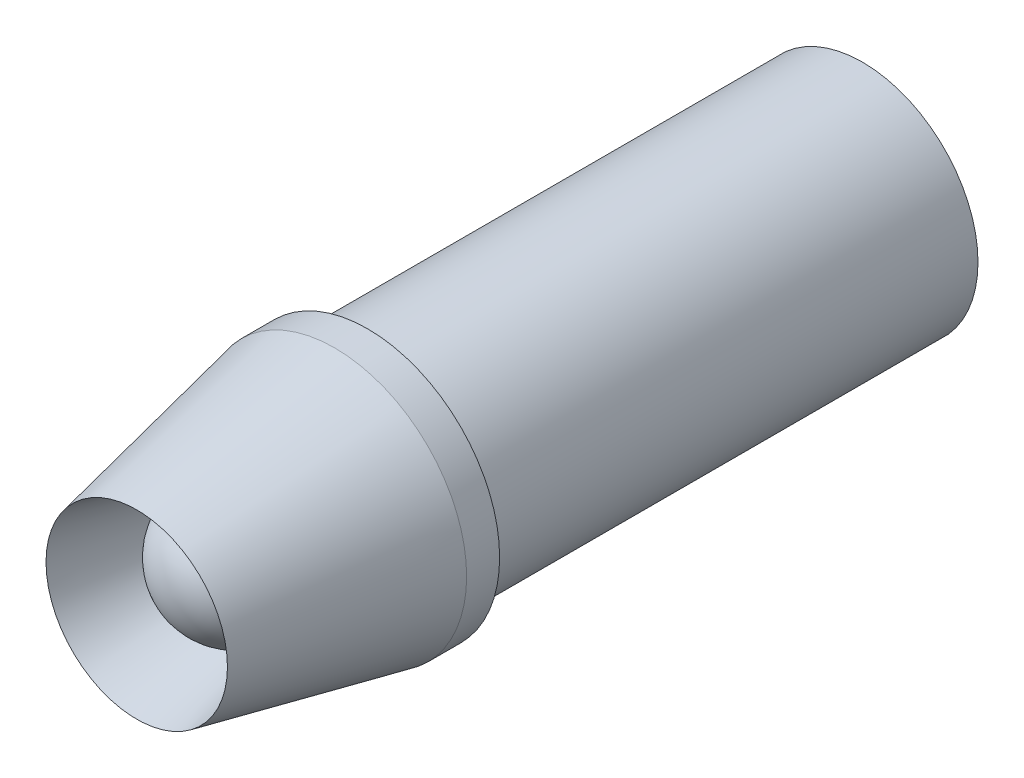
ISO-10303-21;
HEADER;
FILE_DESCRIPTION(('STEP AP214'),'2;1');
FILE_NAME('part.step','',(''),(''),'','','');
FILE_SCHEMA(('AUTOMOTIVE_DESIGN { 1 0 10303 214 1 1 1 1 }'));
ENDSEC;
DATA;
#1=APPLICATION_CONTEXT('core data for automotive mechanical design processes');
#2=APPLICATION_PROTOCOL_DEFINITION('international standard','automotive_design',2000,#1);
#3=PRODUCT_CONTEXT('',#1,'mechanical');
#4=PRODUCT('Part','Part','',(#3));
#5=PRODUCT_RELATED_PRODUCT_CATEGORY('part','',(#4));
#6=PRODUCT_DEFINITION_FORMATION('','',#4);
#7=PRODUCT_DEFINITION_CONTEXT('part definition',#1,'design');
#8=PRODUCT_DEFINITION('design','',#6,#7);
#9=PRODUCT_DEFINITION_SHAPE('','',#8);
#10=(LENGTH_UNIT() NAMED_UNIT(*) SI_UNIT(.MILLI.,.METRE.));
#11=(NAMED_UNIT(*) PLANE_ANGLE_UNIT() SI_UNIT($,.RADIAN.));
#12=(NAMED_UNIT(*) SI_UNIT($,.STERADIAN.) SOLID_ANGLE_UNIT());
#13=UNCERTAINTY_MEASURE_WITH_UNIT(LENGTH_MEASURE(1.E-05),#10,'distance_accuracy_value','');
#14=(GEOMETRIC_REPRESENTATION_CONTEXT(3) GLOBAL_UNCERTAINTY_ASSIGNED_CONTEXT((#13)) GLOBAL_UNIT_ASSIGNED_CONTEXT((#10,
#11,#12)) REPRESENTATION_CONTEXT('',''));
#15=CARTESIAN_POINT('',(0.,0.,0.));
#16=DIRECTION('',(0.,0.,1.));
#17=DIRECTION('',(1.,0.,0.));
#18=AXIS2_PLACEMENT_3D('',#15,#16,#17);
#19=CARTESIAN_POINT('',(0.,0.,3.99999999999997));
#20=DIRECTION('',(0.,0.,1.));
#21=DIRECTION('',(1.,0.,0.));
#22=AXIS2_PLACEMENT_3D('',#19,#20,#21);
#23=PLANE('',#22);
#24=CARTESIAN_POINT('',(0.,0.,3.99999999999997));
#25=DIRECTION('',(0.,0.,1.));
#26=DIRECTION('',(1.,0.,0.));
#27=AXIS2_PLACEMENT_3D('',#24,#25,#26);
#28=CIRCLE('',#27,2.);
#29=CARTESIAN_POINT('',(2.,0.,3.99999999999997));
#30=VERTEX_POINT('',#29);
#31=EDGE_CURVE('E11',#30,#30,#28,.T.);
#32=ORIENTED_EDGE('',*,*,#31,.F.);
#33=EDGE_LOOP('',(#32));
#34=FACE_BOUND('',#33,.T.);
#35=ADVANCED_FACE('F40',(#34),#23,.F.);
#36=CARTESIAN_POINT('',(0.,0.,3.99999999999997));
#37=DIRECTION('',(0.,0.,1.));
#38=DIRECTION('',(1.,0.,0.));
#39=AXIS2_PLACEMENT_3D('',#36,#37,#38);
#40=SPHERICAL_SURFACE('',#39,2.);
#41=ORIENTED_EDGE('',*,*,#31,.T.);
#42=EDGE_LOOP('',(#41));
#43=FACE_BOUND('',#42,.T.);
#44=ADVANCED_FACE('F42',(#43),#40,.T.);
#45=CLOSED_SHELL('',(#35,#44));
#46=MANIFOLD_SOLID_BREP('B2',#45);
#47=CARTESIAN_POINT('',(0.,0.,0.));
#48=DIRECTION('',(0.,0.,1.));
#49=DIRECTION('',(1.,0.,0.));
#50=AXIS2_PLACEMENT_3D('',#47,#48,#49);
#51=PLANE('',#50);
#52=CARTESIAN_POINT('',(0.,0.,0.));
#53=DIRECTION('',(0.,0.,1.));
#54=DIRECTION('',(1.,0.,0.));
#55=AXIS2_PLACEMENT_3D('',#52,#53,#54);
#56=CIRCLE('',#55,3.5);
#57=CARTESIAN_POINT('',(3.5,0.,0.));
#58=VERTEX_POINT('',#57);
#59=EDGE_CURVE('E39',#58,#58,#56,.F.);
#60=ORIENTED_EDGE('',*,*,#59,.F.);
#61=EDGE_LOOP('',(#60));
#62=FACE_BOUND('',#61,.T.);
#63=CARTESIAN_POINT('',(0.,0.,0.));
#64=DIRECTION('',(0.,0.,1.));
#65=DIRECTION('',(1.,0.,0.));
#66=AXIS2_PLACEMENT_3D('',#63,#64,#65);
#67=CIRCLE('',#66,4.);
#68=CARTESIAN_POINT('',(4.,0.,0.));
#69=VERTEX_POINT('',#68);
#70=EDGE_CURVE('E87',#69,#69,#67,.T.);
#71=ORIENTED_EDGE('',*,*,#70,.F.);
#72=EDGE_LOOP('',(#71));
#73=FACE_BOUND('',#72,.T.);
#74=ADVANCED_FACE('F67',(#62,#73),#51,.F.);
#75=CARTESIAN_POINT('',(0.,0.,7.));
#76=DIRECTION('',(0.,0.,-1.));
#77=DIRECTION('',(-1.,0.,0.));
#78=AXIS2_PLACEMENT_3D('',#75,#76,#77);
#79=CYLINDRICAL_SURFACE('',#78,4.);
#80=CARTESIAN_POINT('',(0.,0.,0.999999999999906));
#81=DIRECTION('',(0.,0.,1.));
#82=DIRECTION('',(1.,0.,0.));
#83=AXIS2_PLACEMENT_3D('',#80,#81,#82);
#84=CIRCLE('',#83,4.);
#85=CARTESIAN_POINT('',(-4.,0.,0.999999999999906));
#86=VERTEX_POINT('',#85);
#87=EDGE_CURVE('E78',#86,#86,#84,.F.);
#88=ORIENTED_EDGE('',*,*,#87,.T.);
#89=EDGE_LOOP('',(#88));
#90=FACE_BOUND('',#89,.T.);
#91=ORIENTED_EDGE('',*,*,#70,.T.);
#92=EDGE_LOOP('',(#91));
#93=FACE_BOUND('',#92,.T.);
#94=ADVANCED_FACE('F112',(#90,#93),#79,.T.);
#95=CARTESIAN_POINT('',(0.,0.,7.));
#96=DIRECTION('',(0.,0.,-1.));
#97=DIRECTION('',(-1.,0.,0.));
#98=AXIS2_PLACEMENT_3D('',#95,#96,#97);
#99=CYLINDRICAL_SURFACE('',#98,2.);
#100=CARTESIAN_POINT('',(0.,0.,3.99999999999997));
#101=DIRECTION('',(0.,0.,1.));
#102=DIRECTION('',(1.,0.,0.));
#103=AXIS2_PLACEMENT_3D('',#100,#101,#102);
#104=CIRCLE('',#103,2.);
#105=CARTESIAN_POINT('',(2.,0.,3.99999999999997));
#106=VERTEX_POINT('',#105);
#107=EDGE_CURVE('E74',#106,#106,#104,.T.);
#108=ORIENTED_EDGE('',*,*,#107,.T.);
#109=EDGE_LOOP('',(#108));
#110=FACE_BOUND('',#109,.T.);
#111=CARTESIAN_POINT('',(0.,0.,0.));
#112=DIRECTION('',(0.,0.,1.));
#113=DIRECTION('',(1.,0.,0.));
#114=AXIS2_PLACEMENT_3D('',#111,#112,#113);
#115=CIRCLE('',#114,2.);
#116=CARTESIAN_POINT('',(2.,0.,0.));
#117=VERTEX_POINT('',#116);
#118=EDGE_CURVE('E90',#117,#117,#115,.T.);
#119=ORIENTED_EDGE('',*,*,#118,.F.);
#120=EDGE_LOOP('',(#119));
#121=FACE_BOUND('',#120,.T.);
#122=ADVANCED_FACE('F118',(#110,#121),#99,.F.);
#123=CARTESIAN_POINT('',(0.,0.,7.));
#124=DIRECTION('',(0.,0.,-1.));
#125=DIRECTION('',(-1.,0.,0.));
#126=AXIS2_PLACEMENT_3D('',#123,#124,#125);
#127=CONICAL_SURFACE('',#126,2.75,0.205395389189764);
#128=CARTESIAN_POINT('',(0.,0.,7.));
#129=DIRECTION('',(0.,0.,1.));
#130=DIRECTION('',(1.,0.,0.));
#131=AXIS2_PLACEMENT_3D('',#128,#129,#130);
#132=CIRCLE('',#131,2.75);
#133=CARTESIAN_POINT('',(-2.75,0.,7.));
#134=VERTEX_POINT('',#133);
#135=EDGE_CURVE('E82',#134,#134,#132,.T.);
#136=CARTESIAN_POINT('',(-4.,0.,0.999999999999906));
#137=CARTESIAN_POINT('',(-3.98697916666667,0.,1.06249999999991));
#138=CARTESIAN_POINT('',(-3.97395833333333,0.,1.12499999999991));
#139=CARTESIAN_POINT('',(-3.94791666666667,0.,1.24999999999991));
#140=CARTESIAN_POINT('',(-3.93489583333333,0.,1.31249999999991));
#141=CARTESIAN_POINT('',(-3.90885416666667,0.,1.43749999999991));
#142=CARTESIAN_POINT('',(-3.89583333333333,0.,1.49999999999991));
#143=CARTESIAN_POINT('',(-3.86979166666667,0.,1.62499999999992));
#144=CARTESIAN_POINT('',(-3.85677083333333,0.,1.68749999999992));
#145=CARTESIAN_POINT('',(-3.83072916666667,0.,1.81249999999992));
#146=CARTESIAN_POINT('',(-3.81770833333333,0.,1.87499999999992));
#147=CARTESIAN_POINT('',(-3.79166666666667,0.,1.99999999999992));
#148=CARTESIAN_POINT('',(-3.77864583333333,0.,2.06249999999992));
#149=CARTESIAN_POINT('',(-3.75260416666667,0.,2.18749999999992));
#150=CARTESIAN_POINT('',(-3.73958333333333,0.,2.24999999999992));
#151=CARTESIAN_POINT('',(-3.71354166666667,0.,2.37499999999993));
#152=CARTESIAN_POINT('',(-3.70052083333333,0.,2.43749999999993));
#153=CARTESIAN_POINT('',(-3.67447916666667,0.,2.56249999999993));
#154=CARTESIAN_POINT('',(-3.66145833333333,0.,2.62499999999993));
#155=CARTESIAN_POINT('',(-3.63541666666667,0.,2.74999999999993));
#156=CARTESIAN_POINT('',(-3.62239583333333,0.,2.81249999999993));
#157=CARTESIAN_POINT('',(-3.59635416666667,0.,2.93749999999994));
#158=CARTESIAN_POINT('',(-3.58333333333333,0.,2.99999999999994));
#159=CARTESIAN_POINT('',(-3.55729166666667,0.,3.12499999999994));
#160=CARTESIAN_POINT('',(-3.54427083333333,0.,3.18749999999994));
#161=CARTESIAN_POINT('',(-3.51822916666667,0.,3.31249999999994));
#162=CARTESIAN_POINT('',(-3.50520833333333,0.,3.37499999999994));
#163=CARTESIAN_POINT('',(-3.47916666666667,0.,3.49999999999994));
#164=CARTESIAN_POINT('',(-3.46614583333333,0.,3.56249999999995));
#165=CARTESIAN_POINT('',(-3.44010416666667,0.,3.68749999999995));
#166=CARTESIAN_POINT('',(-3.42708333333333,0.,3.74999999999995));
#167=CARTESIAN_POINT('',(-3.40104166666667,0.,3.87499999999995));
#168=CARTESIAN_POINT('',(-3.38802083333333,0.,3.93749999999995));
#169=CARTESIAN_POINT('',(-3.36197916666667,0.,4.06249999999995));
#170=CARTESIAN_POINT('',(-3.34895833333333,0.,4.12499999999995));
#171=CARTESIAN_POINT('',(-3.32291666666667,0.,4.24999999999996));
#172=CARTESIAN_POINT('',(-3.30989583333333,0.,4.31249999999996));
#173=CARTESIAN_POINT('',(-3.28385416666667,0.,4.43749999999996));
#174=CARTESIAN_POINT('',(-3.27083333333333,0.,4.49999999999996));
#175=CARTESIAN_POINT('',(-3.24479166666667,0.,4.62499999999996));
#176=CARTESIAN_POINT('',(-3.23177083333333,0.,4.68749999999996));
#177=CARTESIAN_POINT('',(-3.20572916666667,0.,4.81249999999997));
#178=CARTESIAN_POINT('',(-3.19270833333333,0.,4.87499999999997));
#179=CARTESIAN_POINT('',(-3.16666666666667,0.,4.99999999999997));
#180=CARTESIAN_POINT('',(-3.15364583333333,0.,5.06249999999997));
#181=CARTESIAN_POINT('',(-3.12760416666667,0.,5.18749999999997));
#182=CARTESIAN_POINT('',(-3.11458333333333,0.,5.24999999999997));
#183=CARTESIAN_POINT('',(-3.08854166666667,0.,5.37499999999997));
#184=CARTESIAN_POINT('',(-3.07552083333333,0.,5.43749999999997));
#185=CARTESIAN_POINT('',(-3.04947916666667,0.,5.56249999999998));
#186=CARTESIAN_POINT('',(-3.03645833333333,0.,5.62499999999998));
#187=CARTESIAN_POINT('',(-3.01041666666667,0.,5.74999999999998));
#188=CARTESIAN_POINT('',(-2.99739583333333,0.,5.81249999999998));
#189=CARTESIAN_POINT('',(-2.97135416666667,0.,5.93749999999998));
#190=CARTESIAN_POINT('',(-2.95833333333333,0.,5.99999999999998));
#191=CARTESIAN_POINT('',(-2.93229166666667,0.,6.12499999999999));
#192=CARTESIAN_POINT('',(-2.91927083333333,0.,6.18749999999999));
#193=CARTESIAN_POINT('',(-2.89322916666667,0.,6.31249999999999));
#194=CARTESIAN_POINT('',(-2.88020833333333,0.,6.37499999999999));
#195=CARTESIAN_POINT('',(-2.85416666666667,0.,6.49999999999999));
#196=CARTESIAN_POINT('',(-2.84114583333333,0.,6.56249999999999));
#197=CARTESIAN_POINT('',(-2.81510416666667,0.,6.68749999999999));
#198=CARTESIAN_POINT('',(-2.80208333333333,0.,6.75));
#199=CARTESIAN_POINT('',(-2.77604166666667,0.,6.875));
#200=CARTESIAN_POINT('',(-2.76302083333333,0.,6.9375));
#201=CARTESIAN_POINT('',(-2.75,0.,7.));
#202=B_SPLINE_CURVE_WITH_KNOTS('',3,(#136,#137,#138,#139,#140,#141,#142,#143,#144,#145,#146,
#147,#148,#149,#150,#151,#152,#153,#154,#155,#156,#157,#158,#159,#160,#161,#162,#163,#164,#165,
#166,#167,#168,#169,#170,#171,#172,#173,#174,#175,#176,#177,#178,#179,#180,#181,#182,#183,#184,
#185,#186,#187,#188,#189,#190,#191,#192,#193,#194,#195,#196,#197,#198,#199,#200,#201),
.UNSPECIFIED.,.F.,.F.,(4,2,2,2,2,2,2,2,2,2,2,2,2,2,2,2,2,2,2,2,2,2,2,2,2,2,2,2,2,2,2,2,4),(0.,
0.191525791752054,0.383051583504107,0.574577375256162,0.766103167008216,0.957628958760269,
1.14915475051232,1.34068054226438,1.53220633401643,1.72373212576849,1.91525791752054,
2.10678370927259,2.29830950102465,2.4898352927767,2.68136108452875,2.87288687628081,
3.06441266803286,3.25593845978492,3.44746425153697,3.63899004328902,3.83051583504108,
4.02204162679313,4.21356741854519,4.40509321029724,4.59661900204929,4.78814479380135,
4.9796705855534,5.17119637730545,5.36272216905751,5.55424796080956,5.74577375256161,
5.93729954431367,6.12882533606572),.UNSPECIFIED.);
#203=EDGE_CURVE('BSEAM122',#86,#134,#202,.T.);
#204=ORIENTED_EDGE('',*,*,#87,.F.);
#205=ORIENTED_EDGE('',*,*,#135,.F.);
#206=ORIENTED_EDGE('',*,*,#203,.T.);
#207=ORIENTED_EDGE('',*,*,#203,.F.);
#208=EDGE_LOOP('',(#204,#206,#205,#207));
#209=FACE_BOUND('',#208,.T.);
#210=ADVANCED_FACE('F122',(#209),#127,.T.);
#211=CARTESIAN_POINT('',(0.,0.,3.99999999999997));
#212=DIRECTION('',(0.,0.,1.));
#213=DIRECTION('',(1.,0.,0.));
#214=AXIS2_PLACEMENT_3D('',#211,#212,#213);
#215=CONICAL_SURFACE('',#214,2.,0.244978663126861);
#216=ORIENTED_EDGE('',*,*,#135,.T.);
#217=EDGE_LOOP('',(#216));
#218=FACE_BOUND('',#217,.T.);
#219=ORIENTED_EDGE('',*,*,#107,.F.);
#220=EDGE_LOOP('',(#219));
#221=FACE_BOUND('',#220,.T.);
#222=ADVANCED_FACE('F69',(#218,#221),#215,.F.);
#223=CARTESIAN_POINT('',(0.,0.,0.));
#224=DIRECTION('',(0.,0.,-1.));
#225=DIRECTION('',(-1.,0.,0.));
#226=AXIS2_PLACEMENT_3D('',#223,#224,#225);
#227=PLANE('',#226);
#228=ORIENTED_EDGE('',*,*,#118,.T.);
#229=EDGE_LOOP('',(#228));
#230=FACE_BOUND('',#229,.T.);
#231=ADVANCED_FACE('F101',(#230),#227,.F.);
#232=CARTESIAN_POINT('',(0.,0.,-15.));
#233=DIRECTION('',(0.,0.,1.));
#234=DIRECTION('',(1.,0.,0.));
#235=AXIS2_PLACEMENT_3D('',#232,#233,#234);
#236=CYLINDRICAL_SURFACE('',#235,3.5);
#237=CARTESIAN_POINT('',(0.,0.,-15.));
#238=DIRECTION('',(0.,0.,-1.));
#239=DIRECTION('',(-1.,0.,0.));
#240=AXIS2_PLACEMENT_3D('',#237,#238,#239);
#241=CIRCLE('',#240,3.5);
#242=CARTESIAN_POINT('',(-3.5,0.,-15.));
#243=VERTEX_POINT('',#242);
#244=EDGE_CURVE('E93',#243,#243,#241,.T.);
#245=ORIENTED_EDGE('',*,*,#244,.F.);
#246=EDGE_LOOP('',(#245));
#247=FACE_BOUND('',#246,.T.);
#248=ORIENTED_EDGE('',*,*,#59,.T.);
#249=EDGE_LOOP('',(#248));
#250=FACE_BOUND('',#249,.T.);
#251=ADVANCED_FACE('F99',(#247,#250),#236,.T.);
#252=CARTESIAN_POINT('',(0.,0.,-15.));
#253=DIRECTION('',(0.,0.,-1.));
#254=DIRECTION('',(-1.,0.,0.));
#255=AXIS2_PLACEMENT_3D('',#252,#253,#254);
#256=PLANE('',#255);
#257=ORIENTED_EDGE('',*,*,#244,.T.);
#258=EDGE_LOOP('',(#257));
#259=FACE_BOUND('',#258,.T.);
#260=ADVANCED_FACE('F97',(#259),#256,.T.);
#261=CLOSED_SHELL('',(#74,#94,#122,#210,#222,#231,#251,#260));
#262=MANIFOLD_SOLID_BREP('B6',#261);
#263=ADVANCED_BREP_SHAPE_REPRESENTATION('',(#18,#46,#262),#14);
#264=SHAPE_DEFINITION_REPRESENTATION(#9,#263);
ENDSEC;
END-ISO-10303-21;
